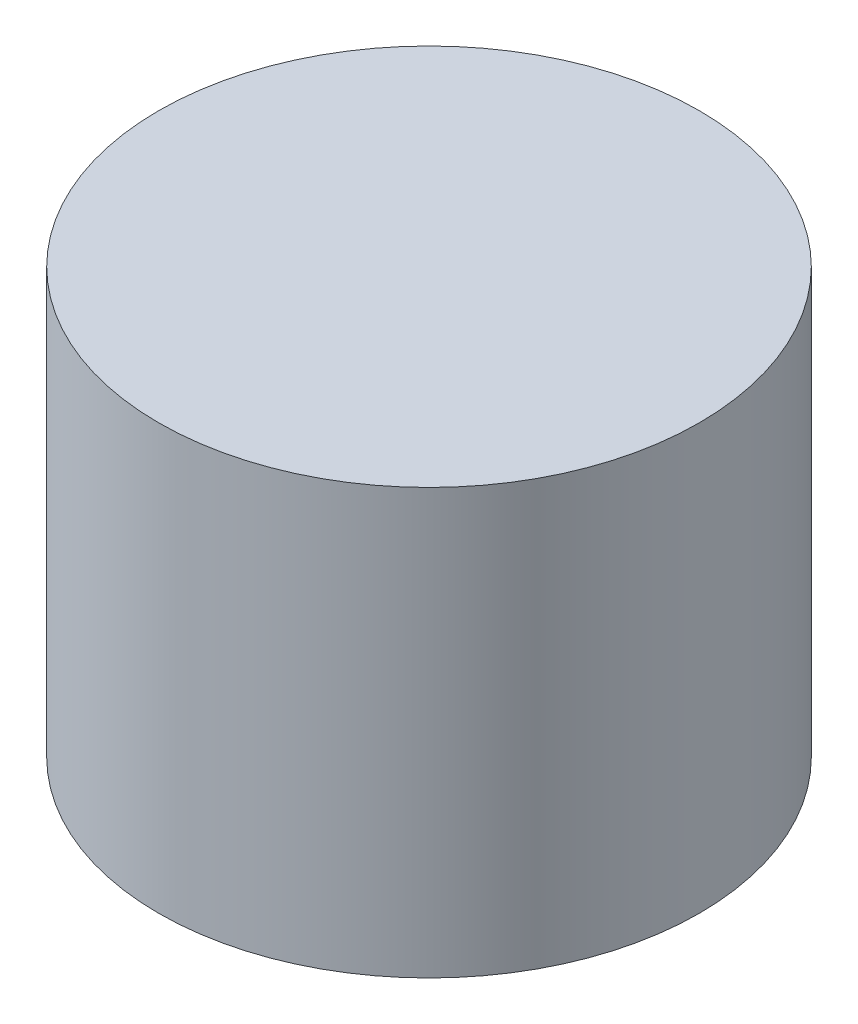
ISO-10303-21;
HEADER;
FILE_DESCRIPTION(('STEP AP214'),'2;1');
FILE_NAME('part.step','',(''),(''),'','','');
FILE_SCHEMA(('AUTOMOTIVE_DESIGN { 1 0 10303 214 1 1 1 1 }'));
ENDSEC;
DATA;
#1=APPLICATION_CONTEXT('core data for automotive mechanical design processes');
#2=APPLICATION_PROTOCOL_DEFINITION('international standard','automotive_design',2000,#1);
#3=PRODUCT_CONTEXT('',#1,'mechanical');
#4=PRODUCT('Part','Part','',(#3));
#5=PRODUCT_RELATED_PRODUCT_CATEGORY('part','',(#4));
#6=PRODUCT_DEFINITION_FORMATION('','',#4);
#7=PRODUCT_DEFINITION_CONTEXT('part definition',#1,'design');
#8=PRODUCT_DEFINITION('design','',#6,#7);
#9=PRODUCT_DEFINITION_SHAPE('','',#8);
#10=(LENGTH_UNIT() NAMED_UNIT(*) SI_UNIT(.MILLI.,.METRE.));
#11=(NAMED_UNIT(*) PLANE_ANGLE_UNIT() SI_UNIT($,.RADIAN.));
#12=(NAMED_UNIT(*) SI_UNIT($,.STERADIAN.) SOLID_ANGLE_UNIT());
#13=UNCERTAINTY_MEASURE_WITH_UNIT(LENGTH_MEASURE(1.E-05),#10,'distance_accuracy_value','');
#14=(GEOMETRIC_REPRESENTATION_CONTEXT(3) GLOBAL_UNCERTAINTY_ASSIGNED_CONTEXT((#13)) GLOBAL_UNIT_ASSIGNED_CONTEXT((#10,
#11,#12)) REPRESENTATION_CONTEXT('',''));
#15=CARTESIAN_POINT('',(0.,0.,0.));
#16=DIRECTION('',(0.,0.,1.));
#17=DIRECTION('',(1.,0.,0.));
#18=AXIS2_PLACEMENT_3D('',#15,#16,#17);
#19=CARTESIAN_POINT('',(0.,55.,0.));
#20=DIRECTION('',(0.,-1.,0.));
#21=DIRECTION('',(0.,0.,-1.));
#22=AXIS2_PLACEMENT_3D('',#19,#20,#21);
#23=CYLINDRICAL_SURFACE('',#22,35.);
#24=CARTESIAN_POINT('',(0.,55.,0.));
#25=DIRECTION('',(0.,1.,0.));
#26=DIRECTION('',(0.,0.,1.));
#27=AXIS2_PLACEMENT_3D('',#24,#25,#26);
#28=CIRCLE('',#27,35.);
#29=CARTESIAN_POINT('',(0.,55.,35.));
#30=VERTEX_POINT('',#29);
#31=EDGE_CURVE('E10',#30,#30,#28,.T.);
#32=ORIENTED_EDGE('',*,*,#31,.F.);
#33=EDGE_LOOP('',(#32));
#34=FACE_BOUND('',#33,.T.);
#35=CARTESIAN_POINT('',(0.,0.,0.));
#36=DIRECTION('',(0.,1.,0.));
#37=DIRECTION('',(0.,0.,1.));
#38=AXIS2_PLACEMENT_3D('',#35,#36,#37);
#39=CIRCLE('',#38,35.);
#40=CARTESIAN_POINT('',(0.,0.,35.));
#41=VERTEX_POINT('',#40);
#42=EDGE_CURVE('E34',#41,#41,#39,.T.);
#43=ORIENTED_EDGE('',*,*,#42,.T.);
#44=EDGE_LOOP('',(#43));
#45=FACE_BOUND('',#44,.T.);
#46=ADVANCED_FACE('F31',(#34,#45),#23,.T.);
#47=CARTESIAN_POINT('',(0.,55.,0.));
#48=DIRECTION('',(0.,1.,0.));
#49=DIRECTION('',(0.,0.,1.));
#50=AXIS2_PLACEMENT_3D('',#47,#48,#49);
#51=PLANE('',#50);
#52=ORIENTED_EDGE('',*,*,#31,.T.);
#53=EDGE_LOOP('',(#52));
#54=FACE_BOUND('',#53,.T.);
#55=ADVANCED_FACE('F46',(#54),#51,.T.);
#56=CARTESIAN_POINT('',(0.,0.,0.));
#57=DIRECTION('',(0.,1.,0.));
#58=DIRECTION('',(0.,0.,1.));
#59=AXIS2_PLACEMENT_3D('',#56,#57,#58);
#60=PLANE('',#59);
#61=ORIENTED_EDGE('',*,*,#42,.F.);
#62=EDGE_LOOP('',(#61));
#63=FACE_BOUND('',#62,.T.);
#64=ADVANCED_FACE('F44',(#63),#60,.F.);
#65=CLOSED_SHELL('',(#46,#55,#64));
#66=MANIFOLD_SOLID_BREP('B2',#65);
#67=ADVANCED_BREP_SHAPE_REPRESENTATION('',(#18,#66),#14);
#68=SHAPE_DEFINITION_REPRESENTATION(#9,#67);
ENDSEC;
END-ISO-10303-21;
